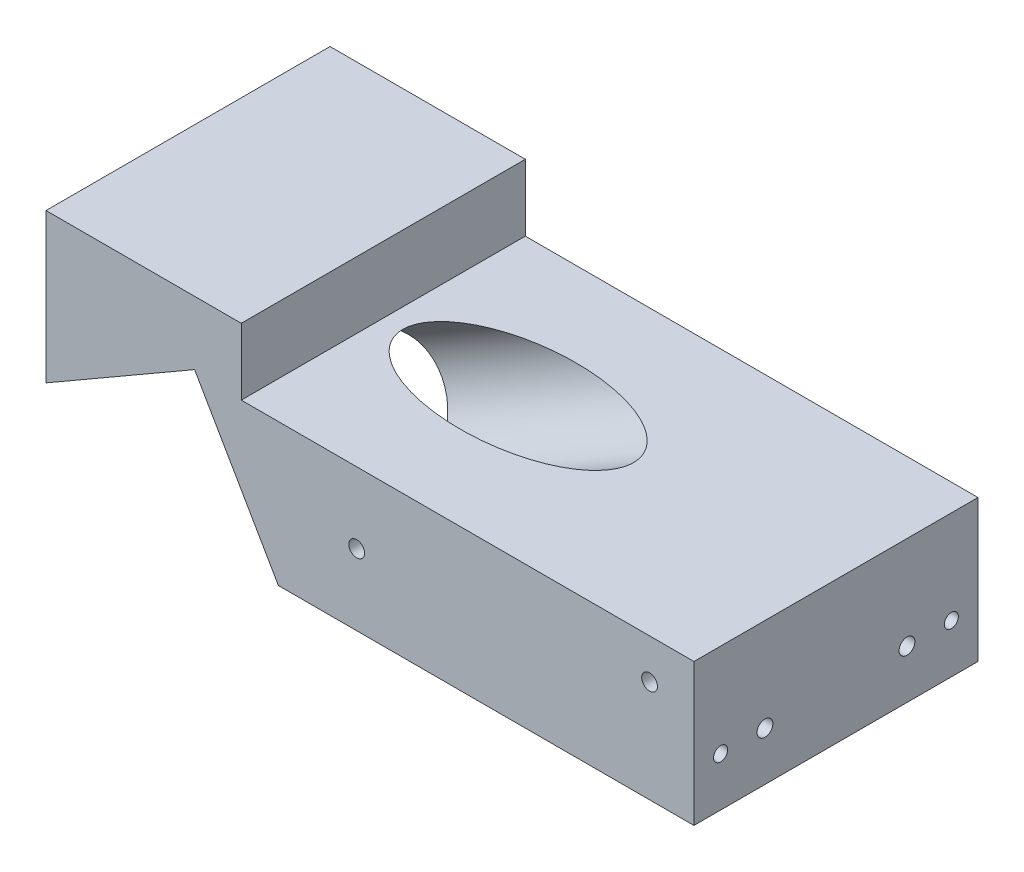
ISO-10303-21;
HEADER;
FILE_DESCRIPTION(('STEP AP214'),'2;1');
FILE_NAME('part.step','',(''),(''),'','','');
FILE_SCHEMA(('AUTOMOTIVE_DESIGN { 1 0 10303 214 1 1 1 1 }'));
ENDSEC;
DATA;
#1=APPLICATION_CONTEXT('core data for automotive mechanical design processes');
#2=APPLICATION_PROTOCOL_DEFINITION('international standard','automotive_design',2000,#1);
#3=PRODUCT_CONTEXT('',#1,'mechanical');
#4=PRODUCT('Part','Part','',(#3));
#5=PRODUCT_RELATED_PRODUCT_CATEGORY('part','',(#4));
#6=PRODUCT_DEFINITION_FORMATION('','',#4);
#7=PRODUCT_DEFINITION_CONTEXT('part definition',#1,'design');
#8=PRODUCT_DEFINITION('design','',#6,#7);
#9=PRODUCT_DEFINITION_SHAPE('','',#8);
#10=(LENGTH_UNIT() NAMED_UNIT(*) SI_UNIT(.MILLI.,.METRE.));
#11=(NAMED_UNIT(*) PLANE_ANGLE_UNIT() SI_UNIT($,.RADIAN.));
#12=(NAMED_UNIT(*) SI_UNIT($,.STERADIAN.) SOLID_ANGLE_UNIT());
#13=UNCERTAINTY_MEASURE_WITH_UNIT(LENGTH_MEASURE(1.E-05),#10,'distance_accuracy_value','');
#14=(GEOMETRIC_REPRESENTATION_CONTEXT(3) GLOBAL_UNCERTAINTY_ASSIGNED_CONTEXT((#13)) GLOBAL_UNIT_ASSIGNED_CONTEXT((#10,
#11,#12)) REPRESENTATION_CONTEXT('',''));
#15=CARTESIAN_POINT('',(0.,0.,0.));
#16=DIRECTION('',(0.,0.,1.));
#17=DIRECTION('',(1.,0.,0.));
#18=AXIS2_PLACEMENT_3D('',#15,#16,#17);
#19=CARTESIAN_POINT('',(0.,16.,0.));
#20=DIRECTION('',(0.,1.,0.));
#21=DIRECTION('',(0.,0.,1.));
#22=AXIS2_PLACEMENT_3D('',#19,#20,#21);
#23=PLANE('',#22);
#24=CARTESIAN_POINT('',(0.690672830051371,16.,0.));
#25=DIRECTION('',(0.,1.,0.));
#26=DIRECTION('',(1.,0.,0.));
#27=AXIS2_PLACEMENT_3D('',#24,#25,#26);
#28=ELLIPSE('',#27,13.0000000000001,6.5);
#29=CARTESIAN_POINT('',(13.6906728300515,16.,0.));
#30=VERTEX_POINT('',#29);
#31=EDGE_CURVE('E271',#30,#30,#28,.F.);
#32=ORIENTED_EDGE('',*,*,#31,.T.);
#33=EDGE_LOOP('',(#32));
#34=FACE_BOUND('',#33,.T.);
#35=DIRECTION('',(-1.,0.,0.));
#36=VECTOR('',#35,1.);
#37=CARTESIAN_POINT('',(-36.5,16.,-16.));
#38=LINE('',#37,#36);
#39=CARTESIAN_POINT('',(36.5,16.,-16.));
#40=VERTEX_POINT('',#39);
#41=CARTESIAN_POINT('',(-14.5,16.,-16.));
#42=VERTEX_POINT('',#41);
#43=EDGE_CURVE('E318',#40,#42,#38,.T.);
#44=ORIENTED_EDGE('',*,*,#43,.T.);
#45=DIRECTION('',(0.,0.,1.));
#46=VECTOR('',#45,1.);
#47=CARTESIAN_POINT('',(-14.5,16.,-39.2432785983389));
#48=LINE('',#47,#46);
#49=CARTESIAN_POINT('',(-14.5,16.,16.));
#50=VERTEX_POINT('',#49);
#51=EDGE_CURVE('E305',#42,#50,#48,.T.);
#52=ORIENTED_EDGE('',*,*,#51,.T.);
#53=DIRECTION('',(1.,0.,0.));
#54=VECTOR('',#53,1.);
#55=CARTESIAN_POINT('',(-36.5,16.,16.));
#56=LINE('',#55,#54);
#57=CARTESIAN_POINT('',(36.5,16.,16.));
#58=VERTEX_POINT('',#57);
#59=EDGE_CURVE('E323',#50,#58,#56,.T.);
#60=ORIENTED_EDGE('',*,*,#59,.T.);
#61=DIRECTION('',(0.,0.,-1.));
#62=VECTOR('',#61,1.);
#63=CARTESIAN_POINT('',(36.5,16.,-16.));
#64=LINE('',#63,#62);
#65=EDGE_CURVE('E314',#58,#40,#64,.T.);
#66=ORIENTED_EDGE('',*,*,#65,.T.);
#67=EDGE_LOOP('',(#44,#52,#60,#66));
#68=FACE_BOUND('',#67,.T.);
#69=ADVANCED_FACE('F53',(#34,#68),#23,.T.);
#70=CARTESIAN_POINT('',(36.5,16.,-16.));
#71=DIRECTION('',(-1.,0.,0.));
#72=DIRECTION('',(0.,0.,1.));
#73=AXIS2_PLACEMENT_3D('',#70,#71,#72);
#74=PLANE('',#73);
#75=CARTESIAN_POINT('',(36.5,5.50000000000001,-13.));
#76=DIRECTION('',(1.,0.,0.));
#77=DIRECTION('',(0.,0.,-1.));
#78=AXIS2_PLACEMENT_3D('',#75,#76,#77);
#79=CIRCLE('',#78,0.793749999999998);
#80=CARTESIAN_POINT('',(36.5,5.50000000000001,-13.79375));
#81=VERTEX_POINT('',#80);
#82=EDGE_CURVE('E170',#81,#81,#79,.T.);
#83=ORIENTED_EDGE('',*,*,#82,.F.);
#84=EDGE_LOOP('',(#83));
#85=FACE_BOUND('',#84,.T.);
#86=CARTESIAN_POINT('',(36.5,5.50000000000001,13.));
#87=DIRECTION('',(1.,0.,0.));
#88=DIRECTION('',(0.,0.,-1.));
#89=AXIS2_PLACEMENT_3D('',#86,#87,#88);
#90=CIRCLE('',#89,0.793749999999998);
#91=CARTESIAN_POINT('',(36.5,5.50000000000001,12.20625));
#92=VERTEX_POINT('',#91);
#93=EDGE_CURVE('E169',#92,#92,#90,.T.);
#94=ORIENTED_EDGE('',*,*,#93,.F.);
#95=EDGE_LOOP('',(#94));
#96=FACE_BOUND('',#95,.T.);
#97=CARTESIAN_POINT('',(36.5,5.5,7.99999999999999));
#98=DIRECTION('',(1.,0.,0.));
#99=DIRECTION('',(0.,0.,-1.));
#100=AXIS2_PLACEMENT_3D('',#97,#98,#99);
#101=CIRCLE('',#100,0.888999999999997);
#102=CARTESIAN_POINT('',(36.5,5.5,7.11099999999999));
#103=VERTEX_POINT('',#102);
#104=EDGE_CURVE('E183',#103,#103,#101,.T.);
#105=ORIENTED_EDGE('',*,*,#104,.F.);
#106=EDGE_LOOP('',(#105));
#107=FACE_BOUND('',#106,.T.);
#108=CARTESIAN_POINT('',(36.5,5.50000000000001,-8.00000000000001));
#109=DIRECTION('',(1.,0.,0.));
#110=DIRECTION('',(0.,0.,-1.));
#111=AXIS2_PLACEMENT_3D('',#108,#109,#110);
#112=CIRCLE('',#111,0.888999999999997);
#113=CARTESIAN_POINT('',(36.5,5.50000000000001,-8.88900000000001));
#114=VERTEX_POINT('',#113);
#115=EDGE_CURVE('E191',#114,#114,#112,.T.);
#116=ORIENTED_EDGE('',*,*,#115,.F.);
#117=EDGE_LOOP('',(#116));
#118=FACE_BOUND('',#117,.T.);
#119=DIRECTION('',(0.,0.,-1.));
#120=VECTOR('',#119,1.);
#121=CARTESIAN_POINT('',(36.5,0.,-16.));
#122=LINE('',#121,#120);
#123=CARTESIAN_POINT('',(36.5,0.,16.));
#124=VERTEX_POINT('',#123);
#125=CARTESIAN_POINT('',(36.5,0.,-16.));
#126=VERTEX_POINT('',#125);
#127=EDGE_CURVE('E298',#124,#126,#122,.T.);
#128=ORIENTED_EDGE('',*,*,#127,.T.);
#129=DIRECTION('',(0.,-1.,0.));
#130=VECTOR('',#129,1.);
#131=CARTESIAN_POINT('',(36.5,16.,-16.));
#132=LINE('',#131,#130);
#133=EDGE_CURVE('E347',#40,#126,#132,.T.);
#134=ORIENTED_EDGE('',*,*,#133,.F.);
#135=ORIENTED_EDGE('',*,*,#65,.F.);
#136=DIRECTION('',(0.,-1.,0.));
#137=VECTOR('',#136,1.);
#138=CARTESIAN_POINT('',(36.5,16.,16.));
#139=LINE('',#138,#137);
#140=EDGE_CURVE('E326',#58,#124,#139,.T.);
#141=ORIENTED_EDGE('',*,*,#140,.T.);
#142=EDGE_LOOP('',(#128,#134,#135,#141));
#143=FACE_BOUND('',#142,.T.);
#144=ADVANCED_FACE('F55',(#85,#96,#107,#118,#143),#74,.F.);
#145=CARTESIAN_POINT('',(-36.5,16.,-16.));
#146=DIRECTION('',(0.,0.,1.));
#147=DIRECTION('',(1.,0.,0.));
#148=AXIS2_PLACEMENT_3D('',#145,#146,#147);
#149=PLANE('',#148);
#150=CARTESIAN_POINT('',(-31.5,19.,-16.));
#151=DIRECTION('',(0.,0.,-1.));
#152=DIRECTION('',(-1.,0.,0.));
#153=AXIS2_PLACEMENT_3D('',#150,#151,#152);
#154=CIRCLE('',#153,0.888999999999987);
#155=CARTESIAN_POINT('',(-32.389,19.,-16.));
#156=VERTEX_POINT('',#155);
#157=EDGE_CURVE('E199',#156,#156,#154,.T.);
#158=ORIENTED_EDGE('',*,*,#157,.F.);
#159=EDGE_LOOP('',(#158));
#160=FACE_BOUND('',#159,.T.);
#161=CARTESIAN_POINT('',(31.5,11.5,-16.));
#162=DIRECTION('',(0.,0.,-1.));
#163=DIRECTION('',(-1.,0.,0.));
#164=AXIS2_PLACEMENT_3D('',#161,#162,#163);
#165=CIRCLE('',#164,0.888999999999987);
#166=CARTESIAN_POINT('',(30.611,11.5,-16.));
#167=VERTEX_POINT('',#166);
#168=EDGE_CURVE('E239',#167,#167,#165,.T.);
#169=ORIENTED_EDGE('',*,*,#168,.F.);
#170=EDGE_LOOP('',(#169));
#171=FACE_BOUND('',#170,.T.);
#172=CARTESIAN_POINT('',(-1.49999999999999,8.,-16.));
#173=DIRECTION('',(0.,0.,-1.));
#174=DIRECTION('',(-1.,0.,0.));
#175=AXIS2_PLACEMENT_3D('',#172,#173,#174);
#176=CIRCLE('',#175,0.888999999999989);
#177=CARTESIAN_POINT('',(-2.38899999999998,8.,-16.));
#178=VERTEX_POINT('',#177);
#179=EDGE_CURVE('E247',#178,#178,#176,.T.);
#180=ORIENTED_EDGE('',*,*,#179,.F.);
#181=EDGE_LOOP('',(#180));
#182=FACE_BOUND('',#181,.T.);
#183=DIRECTION('',(-1.,0.,0.));
#184=VECTOR('',#183,1.);
#185=CARTESIAN_POINT('',(-36.5,0.,-16.));
#186=LINE('',#185,#184);
#187=CARTESIAN_POINT('',(-10.3193968032061,0.,-16.));
#188=VERTEX_POINT('',#187);
#189=EDGE_CURVE('E330',#126,#188,#186,.T.);
#190=ORIENTED_EDGE('',*,*,#189,.T.);
#191=DIRECTION('',(0.499999999999995,-0.866025403784442,0.));
#192=VECTOR('',#191,1.);
#193=CARTESIAN_POINT('',(-14.4950826251688,7.23250000008439,-16.));
#194=LINE('',#193,#192);
#195=CARTESIAN_POINT('',(-19.7575826251687,16.3474173749156,-16.));
#196=VERTEX_POINT('',#195);
#197=EDGE_CURVE('E70',#196,#188,#194,.T.);
#198=ORIENTED_EDGE('',*,*,#197,.F.);
#199=DIRECTION('',(0.866025403784442,0.499999999999995,0.));
#200=VECTOR('',#199,1.);
#201=CARTESIAN_POINT('',(-19.7575826251687,16.3474173749156,-16.));
#202=LINE('',#201,#200);
#203=CARTESIAN_POINT('',(-36.5,6.68117819667186,-16.));
#204=VERTEX_POINT('',#203);
#205=EDGE_CURVE('E275',#204,#196,#202,.T.);
#206=ORIENTED_EDGE('',*,*,#205,.F.);
#207=DIRECTION('',(0.,-1.,0.));
#208=VECTOR('',#207,1.);
#209=CARTESIAN_POINT('',(-36.5,16.,-16.));
#210=LINE('',#209,#208);
#211=CARTESIAN_POINT('',(-36.5,23.5,-16.));
#212=VERTEX_POINT('',#211);
#213=EDGE_CURVE('E343',#212,#204,#210,.T.);
#214=ORIENTED_EDGE('',*,*,#213,.F.);
#215=DIRECTION('',(1.,0.,0.));
#216=VECTOR('',#215,1.);
#217=CARTESIAN_POINT('',(-36.5,23.5,-16.));
#218=LINE('',#217,#216);
#219=CARTESIAN_POINT('',(-14.5,23.5,-16.));
#220=VERTEX_POINT('',#219);
#221=EDGE_CURVE('E294',#212,#220,#218,.T.);
#222=ORIENTED_EDGE('',*,*,#221,.T.);
#223=DIRECTION('',(0.,-1.,0.));
#224=VECTOR('',#223,1.);
#225=CARTESIAN_POINT('',(-14.5,16.,-16.));
#226=LINE('',#225,#224);
#227=EDGE_CURVE('E291',#220,#42,#226,.T.);
#228=ORIENTED_EDGE('',*,*,#227,.T.);
#229=ORIENTED_EDGE('',*,*,#43,.F.);
#230=ORIENTED_EDGE('',*,*,#133,.T.);
#231=EDGE_LOOP('',(#190,#198,#206,#214,#222,#228,#229,#230));
#232=FACE_BOUND('',#231,.T.);
#233=ADVANCED_FACE('F357',(#160,#171,#182,#232),#149,.F.);
#234=CARTESIAN_POINT('',(-36.5,16.,-16.));
#235=DIRECTION('',(1.,0.,0.));
#236=DIRECTION('',(0.,0.,-1.));
#237=AXIS2_PLACEMENT_3D('',#234,#235,#236);
#238=PLANE('',#237);
#239=CARTESIAN_POINT('',(-36.5,14.6811781966719,-10.));
#240=DIRECTION('',(-1.,0.,0.));
#241=DIRECTION('',(0.,0.,1.));
#242=AXIS2_PLACEMENT_3D('',#239,#240,#241);
#243=CIRCLE('',#242,0.888999999999989);
#244=CARTESIAN_POINT('',(-36.5,14.6811781966719,-9.11100000000002));
#245=VERTEX_POINT('',#244);
#246=EDGE_CURVE('E255',#245,#245,#243,.T.);
#247=ORIENTED_EDGE('',*,*,#246,.F.);
#248=EDGE_LOOP('',(#247));
#249=FACE_BOUND('',#248,.T.);
#250=CARTESIAN_POINT('',(-36.5,14.6811781966719,10.));
#251=DIRECTION('',(-1.,0.,0.));
#252=DIRECTION('',(0.,0.,1.));
#253=AXIS2_PLACEMENT_3D('',#250,#251,#252);
#254=CIRCLE('',#253,0.888999999999989);
#255=CARTESIAN_POINT('',(-36.5,14.6811781966719,10.889));
#256=VERTEX_POINT('',#255);
#257=EDGE_CURVE('E263',#256,#256,#254,.T.);
#258=ORIENTED_EDGE('',*,*,#257,.F.);
#259=EDGE_LOOP('',(#258));
#260=FACE_BOUND('',#259,.T.);
#261=ORIENTED_EDGE('',*,*,#213,.T.);
#262=DIRECTION('',(0.,0.,-1.));
#263=VECTOR('',#262,1.);
#264=CARTESIAN_POINT('',(-36.5,6.68117819667186,25.));
#265=LINE('',#264,#263);
#266=CARTESIAN_POINT('',(-36.5,6.68117819667186,16.));
#267=VERTEX_POINT('',#266);
#268=EDGE_CURVE('E281',#267,#204,#265,.T.);
#269=ORIENTED_EDGE('',*,*,#268,.F.);
#270=DIRECTION('',(0.,-1.,0.));
#271=VECTOR('',#270,1.);
#272=CARTESIAN_POINT('',(-36.5,16.,16.));
#273=LINE('',#272,#271);
#274=CARTESIAN_POINT('',(-36.5,23.5,16.));
#275=VERTEX_POINT('',#274);
#276=EDGE_CURVE('E339',#275,#267,#273,.T.);
#277=ORIENTED_EDGE('',*,*,#276,.F.);
#278=DIRECTION('',(0.,0.,1.));
#279=VECTOR('',#278,1.);
#280=CARTESIAN_POINT('',(-36.5,23.5,-39.2432785983389));
#281=LINE('',#280,#279);
#282=EDGE_CURVE('E295',#212,#275,#281,.T.);
#283=ORIENTED_EDGE('',*,*,#282,.F.);
#284=EDGE_LOOP('',(#261,#269,#277,#283));
#285=FACE_BOUND('',#284,.T.);
#286=ADVANCED_FACE('F374',(#249,#260,#285),#238,.F.);
#287=CARTESIAN_POINT('',(-36.5,16.,16.));
#288=DIRECTION('',(0.,0.,-1.));
#289=DIRECTION('',(-1.,0.,0.));
#290=AXIS2_PLACEMENT_3D('',#287,#288,#289);
#291=PLANE('',#290);
#292=CARTESIAN_POINT('',(-1.49999999999999,8.,16.));
#293=DIRECTION('',(0.,0.,1.));
#294=DIRECTION('',(1.,0.,0.));
#295=AXIS2_PLACEMENT_3D('',#292,#293,#294);
#296=CIRCLE('',#295,0.888999999999989);
#297=CARTESIAN_POINT('',(-0.610999999999999,8.,16.));
#298=VERTEX_POINT('',#297);
#299=EDGE_CURVE('E223',#298,#298,#296,.T.);
#300=ORIENTED_EDGE('',*,*,#299,.F.);
#301=EDGE_LOOP('',(#300));
#302=FACE_BOUND('',#301,.T.);
#303=CARTESIAN_POINT('',(31.5,11.5,16.));
#304=DIRECTION('',(0.,0.,1.));
#305=DIRECTION('',(1.,0.,0.));
#306=AXIS2_PLACEMENT_3D('',#303,#304,#305);
#307=CIRCLE('',#306,0.888999999999987);
#308=CARTESIAN_POINT('',(32.389,11.5,16.));
#309=VERTEX_POINT('',#308);
#310=EDGE_CURVE('E231',#309,#309,#307,.T.);
#311=ORIENTED_EDGE('',*,*,#310,.F.);
#312=EDGE_LOOP('',(#311));
#313=FACE_BOUND('',#312,.T.);
#314=DIRECTION('',(0.866025403784442,0.499999999999995,0.));
#315=VECTOR('',#314,1.);
#316=CARTESIAN_POINT('',(-32.4648317924888,9.01088364750384,16.));
#317=LINE('',#316,#315);
#318=CARTESIAN_POINT('',(-19.7575826251687,16.3474173749156,16.));
#319=VERTEX_POINT('',#318);
#320=EDGE_CURVE('E13',#267,#319,#317,.T.);
#321=ORIENTED_EDGE('',*,*,#320,.T.);
#322=DIRECTION('',(0.499999999999995,-0.866025403784442,0.));
#323=VECTOR('',#322,1.);
#324=CARTESIAN_POINT('',(-23.7927508326799,23.3365337274118,16.));
#325=LINE('',#324,#323);
#326=CARTESIAN_POINT('',(-10.3193968032061,0.,16.));
#327=VERTEX_POINT('',#326);
#328=EDGE_CURVE('E285',#319,#327,#325,.T.);
#329=ORIENTED_EDGE('',*,*,#328,.T.);
#330=DIRECTION('',(1.,0.,0.));
#331=VECTOR('',#330,1.);
#332=CARTESIAN_POINT('',(-36.5,0.,16.));
#333=LINE('',#332,#331);
#334=EDGE_CURVE('E319',#327,#124,#333,.T.);
#335=ORIENTED_EDGE('',*,*,#334,.T.);
#336=ORIENTED_EDGE('',*,*,#140,.F.);
#337=ORIENTED_EDGE('',*,*,#59,.F.);
#338=DIRECTION('',(0.,1.,0.));
#339=VECTOR('',#338,1.);
#340=CARTESIAN_POINT('',(-14.5,16.,16.));
#341=LINE('',#340,#339);
#342=CARTESIAN_POINT('',(-14.5,23.5,16.));
#343=VERTEX_POINT('',#342);
#344=EDGE_CURVE('E78',#50,#343,#341,.T.);
#345=ORIENTED_EDGE('',*,*,#344,.T.);
#346=DIRECTION('',(-1.,0.,0.));
#347=VECTOR('',#346,1.);
#348=CARTESIAN_POINT('',(-36.5,23.5,16.));
#349=LINE('',#348,#347);
#350=EDGE_CURVE('E301',#343,#275,#349,.T.);
#351=ORIENTED_EDGE('',*,*,#350,.T.);
#352=ORIENTED_EDGE('',*,*,#276,.T.);
#353=EDGE_LOOP('',(#321,#329,#335,#336,#337,#345,#351,#352));
#354=FACE_BOUND('',#353,.T.);
#355=ADVANCED_FACE('F365',(#302,#313,#354),#291,.F.);
#356=CARTESIAN_POINT('',(0.,0.,0.));
#357=DIRECTION('',(0.,1.,0.));
#358=DIRECTION('',(0.,0.,1.));
#359=AXIS2_PLACEMENT_3D('',#356,#357,#358);
#360=PLANE('',#359);
#361=ORIENTED_EDGE('',*,*,#334,.F.);
#362=DIRECTION('',(0.,0.,-1.));
#363=VECTOR('',#362,1.);
#364=CARTESIAN_POINT('',(-10.3193968032061,0.,0.));
#365=LINE('',#364,#363);
#366=EDGE_CURVE('E63',#327,#188,#365,.T.);
#367=ORIENTED_EDGE('',*,*,#366,.T.);
#368=ORIENTED_EDGE('',*,*,#189,.F.);
#369=ORIENTED_EDGE('',*,*,#127,.F.);
#370=EDGE_LOOP('',(#361,#367,#368,#369));
#371=FACE_BOUND('',#370,.T.);
#372=ADVANCED_FACE('F354',(#371),#360,.F.);
#373=CARTESIAN_POINT('',(-36.5,23.5,-39.2432785983389));
#374=DIRECTION('',(0.,1.,0.));
#375=DIRECTION('',(0.,0.,1.));
#376=AXIS2_PLACEMENT_3D('',#373,#374,#375);
#377=PLANE('',#376);
#378=ORIENTED_EDGE('',*,*,#221,.F.);
#379=ORIENTED_EDGE('',*,*,#282,.T.);
#380=ORIENTED_EDGE('',*,*,#350,.F.);
#381=DIRECTION('',(0.,0.,1.));
#382=VECTOR('',#381,1.);
#383=CARTESIAN_POINT('',(-14.5,23.5,-39.2432785983389));
#384=LINE('',#383,#382);
#385=EDGE_CURVE('E309',#220,#343,#384,.T.);
#386=ORIENTED_EDGE('',*,*,#385,.F.);
#387=EDGE_LOOP('',(#378,#379,#380,#386));
#388=FACE_BOUND('',#387,.T.);
#389=ADVANCED_FACE('F377',(#388),#377,.T.);
#390=CARTESIAN_POINT('',(-14.5,16.,-39.2432785983389));
#391=DIRECTION('',(1.,0.,0.));
#392=DIRECTION('',(0.,1.,0.));
#393=AXIS2_PLACEMENT_3D('',#390,#391,#392);
#394=PLANE('',#393);
#395=ORIENTED_EDGE('',*,*,#227,.F.);
#396=ORIENTED_EDGE('',*,*,#385,.T.);
#397=ORIENTED_EDGE('',*,*,#344,.F.);
#398=ORIENTED_EDGE('',*,*,#51,.F.);
#399=EDGE_LOOP('',(#395,#396,#397,#398));
#400=FACE_BOUND('',#399,.T.);
#401=ADVANCED_FACE('F380',(#400),#394,.T.);
#402=CARTESIAN_POINT('',(-19.7575826251687,16.3474173749156,25.));
#403=DIRECTION('',(-0.499999999999995,0.866025403784442,0.));
#404=DIRECTION('',(-0.866025403784442,-0.499999999999995,0.));
#405=AXIS2_PLACEMENT_3D('',#402,#403,#404);
#406=PLANE('',#405);
#407=ORIENTED_EDGE('',*,*,#268,.T.);
#408=ORIENTED_EDGE('',*,*,#205,.T.);
#409=DIRECTION('',(0.,0.,-1.));
#410=VECTOR('',#409,1.);
#411=CARTESIAN_POINT('',(-19.7575826251687,16.3474173749156,25.));
#412=LINE('',#411,#410);
#413=EDGE_CURVE('E282',#319,#196,#412,.T.);
#414=ORIENTED_EDGE('',*,*,#413,.F.);
#415=ORIENTED_EDGE('',*,*,#320,.F.);
#416=EDGE_LOOP('',(#407,#408,#414,#415));
#417=FACE_BOUND('',#416,.T.);
#418=ADVANCED_FACE('F369',(#417),#406,.F.);
#419=CARTESIAN_POINT('',(-14.4950826251688,7.23250000008439,25.));
#420=DIRECTION('',(0.866025403784442,0.499999999999995,0.));
#421=DIRECTION('',(-0.499999999999995,0.866025403784442,0.));
#422=AXIS2_PLACEMENT_3D('',#419,#420,#421);
#423=PLANE('',#422);
#424=CARTESIAN_POINT('',(-14.4950826251673,7.23250000008182,-10.));
#425=DIRECTION('',(-0.866025403784442,-0.499999999999995,0.));
#426=DIRECTION('',(0.499999999999995,-0.866025403784442,0.));
#427=AXIS2_PLACEMENT_3D('',#424,#425,#426);
#428=CIRCLE('',#427,0.888999999999989);
#429=CARTESIAN_POINT('',(-14.0505826251673,6.46260341611746,-10.));
#430=VERTEX_POINT('',#429);
#431=EDGE_CURVE('E207',#430,#430,#428,.T.);
#432=ORIENTED_EDGE('',*,*,#431,.F.);
#433=EDGE_LOOP('',(#432));
#434=FACE_BOUND('',#433,.T.);
#435=CARTESIAN_POINT('',(-14.4950826251673,7.23250000008182,10.));
#436=DIRECTION('',(-0.866025403784442,-0.499999999999995,0.));
#437=DIRECTION('',(0.499999999999995,-0.866025403784442,0.));
#438=AXIS2_PLACEMENT_3D('',#435,#436,#437);
#439=CIRCLE('',#438,0.888999999999989);
#440=CARTESIAN_POINT('',(-14.0505826251673,6.46260341611746,10.));
#441=VERTEX_POINT('',#440);
#442=EDGE_CURVE('E215',#441,#441,#439,.T.);
#443=ORIENTED_EDGE('',*,*,#442,.F.);
#444=EDGE_LOOP('',(#443));
#445=FACE_BOUND('',#444,.T.);
#446=CARTESIAN_POINT('',(-14.4950826251673,7.23250000008182,0.));
#447=DIRECTION('',(0.866025403784442,0.499999999999995,0.));
#448=DIRECTION('',(-0.499999999999995,0.866025403784442,0.));
#449=AXIS2_PLACEMENT_3D('',#446,#447,#448);
#450=CIRCLE('',#449,6.5);
#451=CARTESIAN_POINT('',(-17.7450826251672,12.8616651246807,0.));
#452=VERTEX_POINT('',#451);
#453=EDGE_CURVE('E57',#452,#452,#450,.F.);
#454=ORIENTED_EDGE('',*,*,#453,.F.);
#455=EDGE_LOOP('',(#454));
#456=FACE_BOUND('',#455,.T.);
#457=ORIENTED_EDGE('',*,*,#413,.T.);
#458=ORIENTED_EDGE('',*,*,#197,.T.);
#459=ORIENTED_EDGE('',*,*,#366,.F.);
#460=ORIENTED_EDGE('',*,*,#328,.F.);
#461=EDGE_LOOP('',(#457,#458,#459,#460));
#462=FACE_BOUND('',#461,.T.);
#463=ADVANCED_FACE('F367',(#434,#445,#456,#462),#423,.F.);
#464=CARTESIAN_POINT('',(-50.0021241803294,-13.267499999918,0.));
#465=DIRECTION('',(0.866025403784442,0.499999999999994,0.));
#466=DIRECTION('',(-0.499999999999995,0.866025403784442,0.));
#467=AXIS2_PLACEMENT_3D('',#464,#465,#466);
#468=CYLINDRICAL_SURFACE('',#467,6.5);
#469=ORIENTED_EDGE('',*,*,#31,.F.);
#470=EDGE_LOOP('',(#469));
#471=FACE_BOUND('',#470,.T.);
#472=ORIENTED_EDGE('',*,*,#453,.T.);
#473=EDGE_LOOP('',(#472));
#474=FACE_BOUND('',#473,.T.);
#475=ADVANCED_FACE('F442',(#471,#474),#468,.F.);
#476=CARTESIAN_POINT('',(-30.15,14.6811781966719,10.));
#477=DIRECTION('',(-1.,0.,0.));
#478=DIRECTION('',(0.,0.,1.));
#479=AXIS2_PLACEMENT_3D('',#476,#477,#478);
#480=CONICAL_SURFACE('',#479,0.888999999999999,1.02974425867665);
#481=CARTESIAN_POINT('',(-29.6158349096845,14.6811781966719,10.));
#482=VERTEX_POINT('',#481);
#483=VERTEX_LOOP('',#482);
#484=FACE_BOUND('',#483,.T.);
#485=CARTESIAN_POINT('',(-30.15,14.6811781966719,10.));
#486=DIRECTION('',(-1.,0.,0.));
#487=DIRECTION('',(0.,0.,1.));
#488=AXIS2_PLACEMENT_3D('',#485,#486,#487);
#489=CIRCLE('',#488,0.888999999999999);
#490=CARTESIAN_POINT('',(-30.15,14.6811781966719,10.889));
#491=VERTEX_POINT('',#490);
#492=EDGE_CURVE('E267',#491,#491,#489,.T.);
#493=ORIENTED_EDGE('',*,*,#492,.T.);
#494=EDGE_LOOP('',(#493));
#495=FACE_BOUND('',#494,.T.);
#496=ADVANCED_FACE('F438',(#484,#495),#480,.F.);
#497=CARTESIAN_POINT('',(-36.5,14.6811781966719,10.));
#498=DIRECTION('',(-1.,0.,0.));
#499=DIRECTION('',(0.,0.,1.));
#500=AXIS2_PLACEMENT_3D('',#497,#498,#499);
#501=CYLINDRICAL_SURFACE('',#500,0.888999999999994);
#502=ORIENTED_EDGE('',*,*,#492,.F.);
#503=EDGE_LOOP('',(#502));
#504=FACE_BOUND('',#503,.T.);
#505=ORIENTED_EDGE('',*,*,#257,.T.);
#506=EDGE_LOOP('',(#505));
#507=FACE_BOUND('',#506,.T.);
#508=ADVANCED_FACE('F434',(#504,#507),#501,.F.);
#509=CARTESIAN_POINT('',(-30.15,14.6811781966719,-10.));
#510=DIRECTION('',(-1.,0.,0.));
#511=DIRECTION('',(0.,0.,1.));
#512=AXIS2_PLACEMENT_3D('',#509,#510,#511);
#513=CONICAL_SURFACE('',#512,0.888999999999999,1.02974425867665);
#514=CARTESIAN_POINT('',(-29.6158349096845,14.6811781966719,-10.));
#515=VERTEX_POINT('',#514);
#516=VERTEX_LOOP('',#515);
#517=FACE_BOUND('',#516,.T.);
#518=CARTESIAN_POINT('',(-30.15,14.6811781966719,-10.));
#519=DIRECTION('',(-1.,0.,0.));
#520=DIRECTION('',(0.,0.,1.));
#521=AXIS2_PLACEMENT_3D('',#518,#519,#520);
#522=CIRCLE('',#521,0.888999999999999);
#523=CARTESIAN_POINT('',(-30.15,14.6811781966719,-9.11100000000001));
#524=VERTEX_POINT('',#523);
#525=EDGE_CURVE('E259',#524,#524,#522,.T.);
#526=ORIENTED_EDGE('',*,*,#525,.T.);
#527=EDGE_LOOP('',(#526));
#528=FACE_BOUND('',#527,.T.);
#529=ADVANCED_FACE('F430',(#517,#528),#513,.F.);
#530=CARTESIAN_POINT('',(-36.5,14.6811781966719,-10.));
#531=DIRECTION('',(-1.,0.,0.));
#532=DIRECTION('',(0.,0.,1.));
#533=AXIS2_PLACEMENT_3D('',#530,#531,#532);
#534=CYLINDRICAL_SURFACE('',#533,0.888999999999994);
#535=ORIENTED_EDGE('',*,*,#525,.F.);
#536=EDGE_LOOP('',(#535));
#537=FACE_BOUND('',#536,.T.);
#538=ORIENTED_EDGE('',*,*,#246,.T.);
#539=EDGE_LOOP('',(#538));
#540=FACE_BOUND('',#539,.T.);
#541=ADVANCED_FACE('F422',(#537,#540),#534,.F.);
#542=CARTESIAN_POINT('',(-1.49999999999999,8.,-9.65000000000001));
#543=DIRECTION('',(0.,0.,-1.));
#544=DIRECTION('',(-1.,0.,0.));
#545=AXIS2_PLACEMENT_3D('',#542,#543,#544);
#546=CONICAL_SURFACE('',#545,0.888999999999987,1.02974425867665);
#547=CARTESIAN_POINT('',(-1.49999999999999,8.,-9.11583490968452));
#548=VERTEX_POINT('',#547);
#549=VERTEX_LOOP('',#548);
#550=FACE_BOUND('',#549,.T.);
#551=CARTESIAN_POINT('',(-1.49999999999999,8.,-9.65000000000001));
#552=DIRECTION('',(0.,0.,-1.));
#553=DIRECTION('',(-1.,0.,0.));
#554=AXIS2_PLACEMENT_3D('',#551,#552,#553);
#555=CIRCLE('',#554,0.888999999999987);
#556=CARTESIAN_POINT('',(-2.38899999999997,8.,-9.65000000000001));
#557=VERTEX_POINT('',#556);
#558=EDGE_CURVE('E251',#557,#557,#555,.T.);
#559=ORIENTED_EDGE('',*,*,#558,.T.);
#560=EDGE_LOOP('',(#559));
#561=FACE_BOUND('',#560,.T.);
#562=ADVANCED_FACE('F412',(#550,#561),#546,.F.);
#563=CARTESIAN_POINT('',(-1.49999999999999,8.,-16.));
#564=DIRECTION('',(0.,0.,-1.));
#565=DIRECTION('',(-1.,0.,0.));
#566=AXIS2_PLACEMENT_3D('',#563,#564,#565);
#567=CYLINDRICAL_SURFACE('',#566,0.888999999999988);
#568=ORIENTED_EDGE('',*,*,#558,.F.);
#569=EDGE_LOOP('',(#568));
#570=FACE_BOUND('',#569,.T.);
#571=ORIENTED_EDGE('',*,*,#179,.T.);
#572=EDGE_LOOP('',(#571));
#573=FACE_BOUND('',#572,.T.);
#574=ADVANCED_FACE('F409',(#570,#573),#567,.F.);
#575=CARTESIAN_POINT('',(31.5,11.5,-9.65000000000001));
#576=DIRECTION('',(0.,0.,-1.));
#577=DIRECTION('',(-1.,0.,0.));
#578=AXIS2_PLACEMENT_3D('',#575,#576,#577);
#579=CONICAL_SURFACE('',#578,0.888999999999987,1.02974425867665);
#580=CARTESIAN_POINT('',(31.5,11.5,-9.11583490968452));
#581=VERTEX_POINT('',#580);
#582=VERTEX_LOOP('',#581);
#583=FACE_BOUND('',#582,.T.);
#584=CARTESIAN_POINT('',(31.5,11.5,-9.65000000000001));
#585=DIRECTION('',(0.,0.,-1.));
#586=DIRECTION('',(-1.,0.,0.));
#587=AXIS2_PLACEMENT_3D('',#584,#585,#586);
#588=CIRCLE('',#587,0.888999999999987);
#589=CARTESIAN_POINT('',(30.611,11.5,-9.65000000000001));
#590=VERTEX_POINT('',#589);
#591=EDGE_CURVE('E243',#590,#590,#588,.T.);
#592=ORIENTED_EDGE('',*,*,#591,.T.);
#593=EDGE_LOOP('',(#592));
#594=FACE_BOUND('',#593,.T.);
#595=ADVANCED_FACE('F411',(#583,#594),#579,.F.);
#596=CARTESIAN_POINT('',(31.5,11.5,-16.));
#597=DIRECTION('',(0.,0.,-1.));
#598=DIRECTION('',(-1.,0.,0.));
#599=AXIS2_PLACEMENT_3D('',#596,#597,#598);
#600=CYLINDRICAL_SURFACE('',#599,0.888999999999987);
#601=ORIENTED_EDGE('',*,*,#591,.F.);
#602=EDGE_LOOP('',(#601));
#603=FACE_BOUND('',#602,.T.);
#604=ORIENTED_EDGE('',*,*,#168,.T.);
#605=EDGE_LOOP('',(#604));
#606=FACE_BOUND('',#605,.T.);
#607=ADVANCED_FACE('F419',(#603,#606),#600,.F.);
#608=CARTESIAN_POINT('',(31.5,11.5,9.65));
#609=DIRECTION('',(0.,0.,1.));
#610=DIRECTION('',(1.,0.,0.));
#611=AXIS2_PLACEMENT_3D('',#608,#609,#610);
#612=CONICAL_SURFACE('',#611,0.888999999999987,1.02974425867665);
#613=CARTESIAN_POINT('',(31.5,11.5,9.11583490968451));
#614=VERTEX_POINT('',#613);
#615=VERTEX_LOOP('',#614);
#616=FACE_BOUND('',#615,.T.);
#617=CARTESIAN_POINT('',(31.5,11.5,9.65));
#618=DIRECTION('',(0.,0.,1.));
#619=DIRECTION('',(1.,0.,0.));
#620=AXIS2_PLACEMENT_3D('',#617,#618,#619);
#621=CIRCLE('',#620,0.888999999999987);
#622=CARTESIAN_POINT('',(32.389,11.5,9.65));
#623=VERTEX_POINT('',#622);
#624=EDGE_CURVE('E235',#623,#623,#621,.T.);
#625=ORIENTED_EDGE('',*,*,#624,.T.);
#626=EDGE_LOOP('',(#625));
#627=FACE_BOUND('',#626,.T.);
#628=ADVANCED_FACE('F522',(#616,#627),#612,.F.);
#629=CARTESIAN_POINT('',(31.5,11.5,16.));
#630=DIRECTION('',(0.,0.,1.));
#631=DIRECTION('',(1.,0.,0.));
#632=AXIS2_PLACEMENT_3D('',#629,#630,#631);
#633=CYLINDRICAL_SURFACE('',#632,0.888999999999987);
#634=ORIENTED_EDGE('',*,*,#624,.F.);
#635=EDGE_LOOP('',(#634));
#636=FACE_BOUND('',#635,.T.);
#637=ORIENTED_EDGE('',*,*,#310,.T.);
#638=EDGE_LOOP('',(#637));
#639=FACE_BOUND('',#638,.T.);
#640=ADVANCED_FACE('F541',(#636,#639),#633,.F.);
#641=CARTESIAN_POINT('',(-1.49999999999999,8.,9.65));
#642=DIRECTION('',(0.,0.,1.));
#643=DIRECTION('',(1.,0.,0.));
#644=AXIS2_PLACEMENT_3D('',#641,#642,#643);
#645=CONICAL_SURFACE('',#644,0.888999999999987,1.02974425867665);
#646=CARTESIAN_POINT('',(-1.49999999999999,8.,9.11583490968451));
#647=VERTEX_POINT('',#646);
#648=VERTEX_LOOP('',#647);
#649=FACE_BOUND('',#648,.T.);
#650=CARTESIAN_POINT('',(-1.49999999999999,8.,9.65));
#651=DIRECTION('',(0.,0.,1.));
#652=DIRECTION('',(1.,0.,0.));
#653=AXIS2_PLACEMENT_3D('',#650,#651,#652);
#654=CIRCLE('',#653,0.888999999999987);
#655=CARTESIAN_POINT('',(-0.611,8.,9.65));
#656=VERTEX_POINT('',#655);
#657=EDGE_CURVE('E227',#656,#656,#654,.T.);
#658=ORIENTED_EDGE('',*,*,#657,.T.);
#659=EDGE_LOOP('',(#658));
#660=FACE_BOUND('',#659,.T.);
#661=ADVANCED_FACE('F552',(#649,#660),#645,.F.);
#662=CARTESIAN_POINT('',(-1.49999999999999,8.,16.));
#663=DIRECTION('',(0.,0.,1.));
#664=DIRECTION('',(1.,0.,0.));
#665=AXIS2_PLACEMENT_3D('',#662,#663,#664);
#666=CYLINDRICAL_SURFACE('',#665,0.888999999999988);
#667=ORIENTED_EDGE('',*,*,#657,.F.);
#668=EDGE_LOOP('',(#667));
#669=FACE_BOUND('',#668,.T.);
#670=ORIENTED_EDGE('',*,*,#299,.T.);
#671=EDGE_LOOP('',(#670));
#672=FACE_BOUND('',#671,.T.);
#673=ADVANCED_FACE('F563',(#669,#672),#666,.F.);
#674=CARTESIAN_POINT('',(-8.99582131113607,10.4075000000818,10.));
#675=DIRECTION('',(-0.866025403784442,-0.499999999999995,0.));
#676=DIRECTION('',(0.499999999999995,-0.866025403784442,0.));
#677=AXIS2_PLACEMENT_3D('',#674,#675,#676);
#678=CONICAL_SURFACE('',#677,0.888999999999987,1.02974425867665);
#679=CARTESIAN_POINT('',(-8.53322077310804,10.6745825452395,10.));
#680=VERTEX_POINT('',#679);
#681=VERTEX_LOOP('',#680);
#682=FACE_BOUND('',#681,.T.);
#683=CARTESIAN_POINT('',(-8.99582131113607,10.4075000000818,10.));
#684=DIRECTION('',(-0.866025403784442,-0.499999999999995,0.));
#685=DIRECTION('',(0.499999999999995,-0.866025403784442,0.));
#686=AXIS2_PLACEMENT_3D('',#683,#684,#685);
#687=CIRCLE('',#686,0.888999999999987);
#688=CARTESIAN_POINT('',(-8.55132131113608,9.63760341611743,10.));
#689=VERTEX_POINT('',#688);
#690=EDGE_CURVE('E219',#689,#689,#687,.T.);
#691=ORIENTED_EDGE('',*,*,#690,.T.);
#692=EDGE_LOOP('',(#691));
#693=FACE_BOUND('',#692,.T.);
#694=ADVANCED_FACE('F572',(#682,#693),#678,.F.);
#695=CARTESIAN_POINT('',(-14.4950826251673,7.23250000008182,10.));
#696=DIRECTION('',(-0.866025403784442,-0.499999999999995,0.));
#697=DIRECTION('',(0.499999999999995,-0.866025403784442,0.));
#698=AXIS2_PLACEMENT_3D('',#695,#696,#697);
#699=CYLINDRICAL_SURFACE('',#698,0.888999999999988);
#700=ORIENTED_EDGE('',*,*,#690,.F.);
#701=EDGE_LOOP('',(#700));
#702=FACE_BOUND('',#701,.T.);
#703=ORIENTED_EDGE('',*,*,#442,.T.);
#704=EDGE_LOOP('',(#703));
#705=FACE_BOUND('',#704,.T.);
#706=ADVANCED_FACE('F585',(#702,#705),#699,.F.);
#707=CARTESIAN_POINT('',(-8.99582131113607,10.4075000000818,-10.));
#708=DIRECTION('',(-0.866025403784442,-0.499999999999995,0.));
#709=DIRECTION('',(0.499999999999995,-0.866025403784442,0.));
#710=AXIS2_PLACEMENT_3D('',#707,#708,#709);
#711=CONICAL_SURFACE('',#710,0.888999999999987,1.02974425867665);
#712=CARTESIAN_POINT('',(-8.53322077310804,10.6745825452395,-10.));
#713=VERTEX_POINT('',#712);
#714=VERTEX_LOOP('',#713);
#715=FACE_BOUND('',#714,.T.);
#716=CARTESIAN_POINT('',(-8.99582131113607,10.4075000000818,-10.));
#717=DIRECTION('',(-0.866025403784442,-0.499999999999995,0.));
#718=DIRECTION('',(0.499999999999995,-0.866025403784442,0.));
#719=AXIS2_PLACEMENT_3D('',#716,#717,#718);
#720=CIRCLE('',#719,0.888999999999987);
#721=CARTESIAN_POINT('',(-8.55132131113608,9.63760341611743,-10.));
#722=VERTEX_POINT('',#721);
#723=EDGE_CURVE('E211',#722,#722,#720,.T.);
#724=ORIENTED_EDGE('',*,*,#723,.T.);
#725=EDGE_LOOP('',(#724));
#726=FACE_BOUND('',#725,.T.);
#727=ADVANCED_FACE('F590',(#715,#726),#711,.F.);
#728=CARTESIAN_POINT('',(-14.4950826251673,7.23250000008182,-10.));
#729=DIRECTION('',(-0.866025403784442,-0.499999999999995,0.));
#730=DIRECTION('',(0.499999999999995,-0.866025403784442,0.));
#731=AXIS2_PLACEMENT_3D('',#728,#729,#730);
#732=CYLINDRICAL_SURFACE('',#731,0.888999999999988);
#733=ORIENTED_EDGE('',*,*,#723,.F.);
#734=EDGE_LOOP('',(#733));
#735=FACE_BOUND('',#734,.T.);
#736=ORIENTED_EDGE('',*,*,#431,.T.);
#737=EDGE_LOOP('',(#736));
#738=FACE_BOUND('',#737,.T.);
#739=ADVANCED_FACE('F598',(#735,#738),#732,.F.);
#740=CARTESIAN_POINT('',(-31.5,19.,-11.24));
#741=DIRECTION('',(0.,0.,-1.));
#742=DIRECTION('',(-1.,0.,0.));
#743=AXIS2_PLACEMENT_3D('',#740,#741,#742);
#744=CONICAL_SURFACE('',#743,0.888999999999997,1.02974425867665);
#745=CARTESIAN_POINT('',(-31.5,19.,-10.7058349096845));
#746=VERTEX_POINT('',#745);
#747=VERTEX_LOOP('',#746);
#748=FACE_BOUND('',#747,.T.);
#749=CARTESIAN_POINT('',(-31.5,19.,-11.24));
#750=DIRECTION('',(0.,0.,-1.));
#751=DIRECTION('',(-1.,0.,0.));
#752=AXIS2_PLACEMENT_3D('',#749,#750,#751);
#753=CIRCLE('',#752,0.888999999999997);
#754=CARTESIAN_POINT('',(-32.389,19.,-11.24));
#755=VERTEX_POINT('',#754);
#756=EDGE_CURVE('E203',#755,#755,#753,.T.);
#757=ORIENTED_EDGE('',*,*,#756,.T.);
#758=EDGE_LOOP('',(#757));
#759=FACE_BOUND('',#758,.T.);
#760=ADVANCED_FACE('F602',(#748,#759),#744,.F.);
#761=CARTESIAN_POINT('',(-31.5,19.,-16.));
#762=DIRECTION('',(0.,0.,-1.));
#763=DIRECTION('',(-1.,0.,0.));
#764=AXIS2_PLACEMENT_3D('',#761,#762,#763);
#765=CYLINDRICAL_SURFACE('',#764,0.888999999999992);
#766=ORIENTED_EDGE('',*,*,#756,.F.);
#767=EDGE_LOOP('',(#766));
#768=FACE_BOUND('',#767,.T.);
#769=ORIENTED_EDGE('',*,*,#157,.T.);
#770=EDGE_LOOP('',(#769));
#771=FACE_BOUND('',#770,.T.);
#772=ADVANCED_FACE('F609',(#768,#771),#765,.F.);
#773=CARTESIAN_POINT('',(21.5,5.50000000000001,-8.00000000000001));
#774=DIRECTION('',(1.,0.,0.));
#775=DIRECTION('',(0.,0.,-1.));
#776=AXIS2_PLACEMENT_3D('',#773,#774,#775);
#777=CONICAL_SURFACE('',#776,0.888999999999997,1.02974425867665);
#778=CARTESIAN_POINT('',(20.9658349096845,5.5,-8.00000000000001));
#779=VERTEX_POINT('',#778);
#780=VERTEX_LOOP('',#779);
#781=FACE_BOUND('',#780,.T.);
#782=CARTESIAN_POINT('',(21.5,5.50000000000001,-8.00000000000001));
#783=DIRECTION('',(1.,0.,0.));
#784=DIRECTION('',(0.,0.,-1.));
#785=AXIS2_PLACEMENT_3D('',#782,#783,#784);
#786=CIRCLE('',#785,0.888999999999997);
#787=CARTESIAN_POINT('',(21.5,5.50000000000001,-8.889));
#788=VERTEX_POINT('',#787);
#789=EDGE_CURVE('E195',#788,#788,#786,.T.);
#790=ORIENTED_EDGE('',*,*,#789,.T.);
#791=EDGE_LOOP('',(#790));
#792=FACE_BOUND('',#791,.T.);
#793=ADVANCED_FACE('F612',(#781,#792),#777,.F.);
#794=CARTESIAN_POINT('',(36.5,5.50000000000001,-8.00000000000001));
#795=DIRECTION('',(1.,0.,0.));
#796=DIRECTION('',(0.,0.,-1.));
#797=AXIS2_PLACEMENT_3D('',#794,#795,#796);
#798=CYLINDRICAL_SURFACE('',#797,0.888999999999997);
#799=ORIENTED_EDGE('',*,*,#789,.F.);
#800=EDGE_LOOP('',(#799));
#801=FACE_BOUND('',#800,.T.);
#802=ORIENTED_EDGE('',*,*,#115,.T.);
#803=EDGE_LOOP('',(#802));
#804=FACE_BOUND('',#803,.T.);
#805=ADVANCED_FACE('F625',(#801,#804),#798,.F.);
#806=CARTESIAN_POINT('',(21.5,5.5,7.99999999999999));
#807=DIRECTION('',(1.,0.,0.));
#808=DIRECTION('',(0.,0.,-1.));
#809=AXIS2_PLACEMENT_3D('',#806,#807,#808);
#810=CONICAL_SURFACE('',#809,0.888999999999997,1.02974425867665);
#811=CARTESIAN_POINT('',(20.9658349096845,5.5,7.99999999999999));
#812=VERTEX_POINT('',#811);
#813=VERTEX_LOOP('',#812);
#814=FACE_BOUND('',#813,.T.);
#815=CARTESIAN_POINT('',(21.5,5.5,7.99999999999999));
#816=DIRECTION('',(1.,0.,0.));
#817=DIRECTION('',(0.,0.,-1.));
#818=AXIS2_PLACEMENT_3D('',#815,#816,#817);
#819=CIRCLE('',#818,0.888999999999997);
#820=CARTESIAN_POINT('',(21.5,5.5,7.111));
#821=VERTEX_POINT('',#820);
#822=EDGE_CURVE('E187',#821,#821,#819,.T.);
#823=ORIENTED_EDGE('',*,*,#822,.T.);
#824=EDGE_LOOP('',(#823));
#825=FACE_BOUND('',#824,.T.);
#826=ADVANCED_FACE('F634',(#814,#825),#810,.F.);
#827=CARTESIAN_POINT('',(36.5,5.5,7.99999999999999));
#828=DIRECTION('',(1.,0.,0.));
#829=DIRECTION('',(0.,0.,-1.));
#830=AXIS2_PLACEMENT_3D('',#827,#828,#829);
#831=CYLINDRICAL_SURFACE('',#830,0.888999999999997);
#832=ORIENTED_EDGE('',*,*,#822,.F.);
#833=EDGE_LOOP('',(#832));
#834=FACE_BOUND('',#833,.T.);
#835=ORIENTED_EDGE('',*,*,#104,.T.);
#836=EDGE_LOOP('',(#835));
#837=FACE_BOUND('',#836,.T.);
#838=ADVANCED_FACE('F642',(#834,#837),#831,.F.);
#839=CARTESIAN_POINT('',(30.,5.50000000000001,13.));
#840=DIRECTION('',(1.,0.,0.));
#841=DIRECTION('',(0.,0.,-1.));
#842=AXIS2_PLACEMENT_3D('',#839,#840,#841);
#843=CONICAL_SURFACE('',#842,0.793749999999998,1.02974425867665);
#844=CARTESIAN_POINT('',(29.5230668836469,5.5,13.));
#845=VERTEX_POINT('',#844);
#846=VERTEX_LOOP('',#845);
#847=FACE_BOUND('',#846,.T.);
#848=CARTESIAN_POINT('',(30.,5.50000000000001,13.));
#849=DIRECTION('',(1.,0.,0.));
#850=DIRECTION('',(0.,0.,-1.));
#851=AXIS2_PLACEMENT_3D('',#848,#849,#850);
#852=CIRCLE('',#851,0.793749999999998);
#853=CARTESIAN_POINT('',(30.,5.50000000000001,12.20625));
#854=VERTEX_POINT('',#853);
#855=EDGE_CURVE('E175',#854,#854,#852,.T.);
#856=ORIENTED_EDGE('',*,*,#855,.T.);
#857=EDGE_LOOP('',(#856));
#858=FACE_BOUND('',#857,.T.);
#859=ADVANCED_FACE('F650',(#847,#858),#843,.F.);
#860=CARTESIAN_POINT('',(36.5,5.50000000000001,13.));
#861=DIRECTION('',(1.,0.,0.));
#862=DIRECTION('',(0.,0.,-1.));
#863=AXIS2_PLACEMENT_3D('',#860,#861,#862);
#864=CYLINDRICAL_SURFACE('',#863,0.793749999999998);
#865=ORIENTED_EDGE('',*,*,#855,.F.);
#866=EDGE_LOOP('',(#865));
#867=FACE_BOUND('',#866,.T.);
#868=ORIENTED_EDGE('',*,*,#93,.T.);
#869=EDGE_LOOP('',(#868));
#870=FACE_BOUND('',#869,.T.);
#871=ADVANCED_FACE('F162',(#867,#870),#864,.F.);
#872=CARTESIAN_POINT('',(30.,5.50000000000001,-13.));
#873=DIRECTION('',(1.,0.,0.));
#874=DIRECTION('',(0.,0.,-1.));
#875=AXIS2_PLACEMENT_3D('',#872,#873,#874);
#876=CONICAL_SURFACE('',#875,0.793749999999998,1.02974425867665);
#877=CARTESIAN_POINT('',(29.5230668836469,5.50000000000001,-13.));
#878=VERTEX_POINT('',#877);
#879=VERTEX_LOOP('',#878);
#880=FACE_BOUND('',#879,.T.);
#881=CARTESIAN_POINT('',(30.,5.50000000000001,-13.));
#882=DIRECTION('',(1.,0.,0.));
#883=DIRECTION('',(0.,0.,-1.));
#884=AXIS2_PLACEMENT_3D('',#881,#882,#883);
#885=CIRCLE('',#884,0.793749999999998);
#886=CARTESIAN_POINT('',(30.,5.50000000000001,-13.79375));
#887=VERTEX_POINT('',#886);
#888=EDGE_CURVE('E166',#887,#887,#885,.T.);
#889=ORIENTED_EDGE('',*,*,#888,.T.);
#890=EDGE_LOOP('',(#889));
#891=FACE_BOUND('',#890,.T.);
#892=ADVANCED_FACE('F158',(#880,#891),#876,.F.);
#893=CARTESIAN_POINT('',(36.5,5.50000000000001,-13.));
#894=DIRECTION('',(1.,0.,0.));
#895=DIRECTION('',(0.,0.,-1.));
#896=AXIS2_PLACEMENT_3D('',#893,#894,#895);
#897=CYLINDRICAL_SURFACE('',#896,0.793749999999998);
#898=ORIENTED_EDGE('',*,*,#888,.F.);
#899=EDGE_LOOP('',(#898));
#900=FACE_BOUND('',#899,.T.);
#901=ORIENTED_EDGE('',*,*,#82,.T.);
#902=EDGE_LOOP('',(#901));
#903=FACE_BOUND('',#902,.T.);
#904=ADVANCED_FACE('F161',(#900,#903),#897,.F.);
#905=CLOSED_SHELL('',(#69,#144,#233,#286,#355,#372,#389,#401,#418,#463,#475,#496,#508,#529,#541,
#562,#574,#595,#607,#628,#640,#661,#673,#694,#706,#727,#739,#760,#772,#793,#805,#826,#838,#859,
#871,#892,#904));
#906=MANIFOLD_SOLID_BREP('B2',#905);
#907=ADVANCED_BREP_SHAPE_REPRESENTATION('',(#18,#906),#14);
#908=SHAPE_DEFINITION_REPRESENTATION(#9,#907);
ENDSEC;
END-ISO-10303-21;
